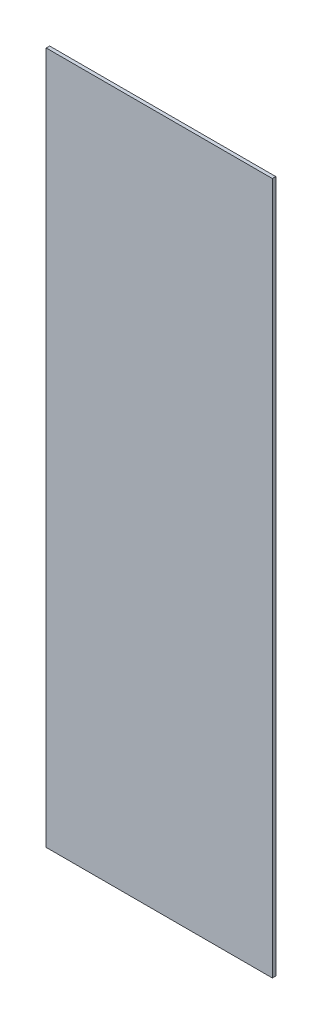
ISO-10303-21;
HEADER;
FILE_DESCRIPTION(('STEP AP214'),'2;1');
FILE_NAME('part.step','',(''),(''),'','','');
FILE_SCHEMA(('AUTOMOTIVE_DESIGN { 1 0 10303 214 1 1 1 1 }'));
ENDSEC;
DATA;
#1=APPLICATION_CONTEXT('core data for automotive mechanical design processes');
#2=APPLICATION_PROTOCOL_DEFINITION('international standard','automotive_design',2000,#1);
#3=PRODUCT_CONTEXT('',#1,'mechanical');
#4=PRODUCT('Part','Part','',(#3));
#5=PRODUCT_RELATED_PRODUCT_CATEGORY('part','',(#4));
#6=PRODUCT_DEFINITION_FORMATION('','',#4);
#7=PRODUCT_DEFINITION_CONTEXT('part definition',#1,'design');
#8=PRODUCT_DEFINITION('design','',#6,#7);
#9=PRODUCT_DEFINITION_SHAPE('','',#8);
#10=(LENGTH_UNIT() NAMED_UNIT(*) SI_UNIT(.MILLI.,.METRE.));
#11=(NAMED_UNIT(*) PLANE_ANGLE_UNIT() SI_UNIT($,.RADIAN.));
#12=(NAMED_UNIT(*) SI_UNIT($,.STERADIAN.) SOLID_ANGLE_UNIT());
#13=UNCERTAINTY_MEASURE_WITH_UNIT(LENGTH_MEASURE(1.E-05),#10,'distance_accuracy_value','');
#14=(GEOMETRIC_REPRESENTATION_CONTEXT(3) GLOBAL_UNCERTAINTY_ASSIGNED_CONTEXT((#13)) GLOBAL_UNIT_ASSIGNED_CONTEXT((#10,
#11,#12)) REPRESENTATION_CONTEXT('',''));
#15=CARTESIAN_POINT('',(0.,0.,0.));
#16=DIRECTION('',(0.,0.,1.));
#17=DIRECTION('',(1.,0.,0.));
#18=AXIS2_PLACEMENT_3D('',#15,#16,#17);
#19=CARTESIAN_POINT('',(-311.909422308907,134.759450171821,5.));
#20=DIRECTION('',(1.,0.,0.));
#21=DIRECTION('',(0.,1.,0.));
#22=AXIS2_PLACEMENT_3D('',#19,#20,#21);
#23=PLANE('',#22);
#24=DIRECTION('',(0.,-1.,0.));
#25=VECTOR('',#24,1.);
#26=CARTESIAN_POINT('',(-311.909422308907,134.759450171821,0.));
#27=LINE('',#26,#25);
#28=CARTESIAN_POINT('',(-311.909422308907,134.759450171821,0.));
#29=VERTEX_POINT('',#28);
#30=CARTESIAN_POINT('',(-311.909422308907,-875.740549828179,0.));
#31=VERTEX_POINT('',#30);
#32=EDGE_CURVE('E107',#29,#31,#27,.T.);
#33=ORIENTED_EDGE('',*,*,#32,.T.);
#34=DIRECTION('',(0.,0.,-1.));
#35=VECTOR('',#34,1.);
#36=CARTESIAN_POINT('',(-311.909422308907,-875.740549828179,5.));
#37=LINE('',#36,#35);
#38=CARTESIAN_POINT('',(-311.909422308907,-875.740549828179,5.));
#39=VERTEX_POINT('',#38);
#40=EDGE_CURVE('E11',#39,#31,#37,.T.);
#41=ORIENTED_EDGE('',*,*,#40,.F.);
#42=DIRECTION('',(0.,-1.,0.));
#43=VECTOR('',#42,1.);
#44=CARTESIAN_POINT('',(-311.909422308907,134.759450171821,5.));
#45=LINE('',#44,#43);
#46=CARTESIAN_POINT('',(-311.909422308907,134.759450171821,5.));
#47=VERTEX_POINT('',#46);
#48=EDGE_CURVE('E91',#47,#39,#45,.T.);
#49=ORIENTED_EDGE('',*,*,#48,.F.);
#50=DIRECTION('',(0.,0.,-1.));
#51=VECTOR('',#50,1.);
#52=CARTESIAN_POINT('',(-311.909422308907,134.759450171821,5.));
#53=LINE('',#52,#51);
#54=EDGE_CURVE('E103',#47,#29,#53,.T.);
#55=ORIENTED_EDGE('',*,*,#54,.T.);
#56=EDGE_LOOP('',(#33,#41,#49,#55));
#57=FACE_BOUND('',#56,.T.);
#58=ADVANCED_FACE('F39',(#57),#23,.F.);
#59=CARTESIAN_POINT('',(-311.909422308907,-875.740549828179,5.));
#60=DIRECTION('',(0.,1.,0.));
#61=DIRECTION('',(0.,0.,1.));
#62=AXIS2_PLACEMENT_3D('',#59,#60,#61);
#63=PLANE('',#62);
#64=DIRECTION('',(1.,0.,0.));
#65=VECTOR('',#64,1.);
#66=CARTESIAN_POINT('',(-311.909422308907,-875.740549828179,0.));
#67=LINE('',#66,#65);
#68=CARTESIAN_POINT('',(18.0905776910933,-875.740549828179,0.));
#69=VERTEX_POINT('',#68);
#70=EDGE_CURVE('E96',#31,#69,#67,.T.);
#71=ORIENTED_EDGE('',*,*,#70,.T.);
#72=DIRECTION('',(0.,0.,-1.));
#73=VECTOR('',#72,1.);
#74=CARTESIAN_POINT('',(18.0905776910933,-875.740549828179,5.));
#75=LINE('',#74,#73);
#76=CARTESIAN_POINT('',(18.0905776910933,-875.740549828179,5.));
#77=VERTEX_POINT('',#76);
#78=EDGE_CURVE('E48',#77,#69,#75,.T.);
#79=ORIENTED_EDGE('',*,*,#78,.F.);
#80=DIRECTION('',(1.,0.,0.));
#81=VECTOR('',#80,1.);
#82=CARTESIAN_POINT('',(-311.909422308907,-875.740549828179,5.));
#83=LINE('',#82,#81);
#84=EDGE_CURVE('E86',#39,#77,#83,.T.);
#85=ORIENTED_EDGE('',*,*,#84,.F.);
#86=ORIENTED_EDGE('',*,*,#40,.T.);
#87=EDGE_LOOP('',(#71,#79,#85,#86));
#88=FACE_BOUND('',#87,.T.);
#89=ADVANCED_FACE('F95',(#88),#63,.F.);
#90=CARTESIAN_POINT('',(18.0905776910932,134.759450171821,5.));
#91=DIRECTION('',(-1.,0.,0.));
#92=DIRECTION('',(0.,-1.,0.));
#93=AXIS2_PLACEMENT_3D('',#90,#91,#92);
#94=PLANE('',#93);
#95=DIRECTION('',(0.,1.,0.));
#96=VECTOR('',#95,1.);
#97=CARTESIAN_POINT('',(18.0905776910932,134.759450171821,0.));
#98=LINE('',#97,#96);
#99=CARTESIAN_POINT('',(18.0905776910932,134.759450171821,0.));
#100=VERTEX_POINT('',#99);
#101=EDGE_CURVE('E73',#69,#100,#98,.T.);
#102=ORIENTED_EDGE('',*,*,#101,.T.);
#103=DIRECTION('',(0.,0.,-1.));
#104=VECTOR('',#103,1.);
#105=CARTESIAN_POINT('',(18.0905776910932,134.759450171821,5.));
#106=LINE('',#105,#104);
#107=CARTESIAN_POINT('',(18.0905776910932,134.759450171821,5.));
#108=VERTEX_POINT('',#107);
#109=EDGE_CURVE('E98',#108,#100,#106,.T.);
#110=ORIENTED_EDGE('',*,*,#109,.F.);
#111=DIRECTION('',(0.,1.,0.));
#112=VECTOR('',#111,1.);
#113=CARTESIAN_POINT('',(18.0905776910932,134.759450171821,5.));
#114=LINE('',#113,#112);
#115=EDGE_CURVE('E89',#77,#108,#114,.T.);
#116=ORIENTED_EDGE('',*,*,#115,.F.);
#117=ORIENTED_EDGE('',*,*,#78,.T.);
#118=EDGE_LOOP('',(#102,#110,#116,#117));
#119=FACE_BOUND('',#118,.T.);
#120=ADVANCED_FACE('F99',(#119),#94,.F.);
#121=CARTESIAN_POINT('',(-311.909422308907,134.759450171821,5.));
#122=DIRECTION('',(0.,-1.,0.));
#123=DIRECTION('',(0.,0.,-1.));
#124=AXIS2_PLACEMENT_3D('',#121,#122,#123);
#125=PLANE('',#124);
#126=DIRECTION('',(-1.,0.,0.));
#127=VECTOR('',#126,1.);
#128=CARTESIAN_POINT('',(-311.909422308907,134.759450171821,0.));
#129=LINE('',#128,#127);
#130=EDGE_CURVE('E79',#100,#29,#129,.T.);
#131=ORIENTED_EDGE('',*,*,#130,.T.);
#132=ORIENTED_EDGE('',*,*,#54,.F.);
#133=DIRECTION('',(-1.,0.,0.));
#134=VECTOR('',#133,1.);
#135=CARTESIAN_POINT('',(-311.909422308907,134.759450171821,5.));
#136=LINE('',#135,#134);
#137=EDGE_CURVE('E56',#108,#47,#136,.T.);
#138=ORIENTED_EDGE('',*,*,#137,.F.);
#139=ORIENTED_EDGE('',*,*,#109,.T.);
#140=EDGE_LOOP('',(#131,#132,#138,#139));
#141=FACE_BOUND('',#140,.T.);
#142=ADVANCED_FACE('F120',(#141),#125,.F.);
#143=CARTESIAN_POINT('',(0.,0.,5.));
#144=DIRECTION('',(0.,0.,1.));
#145=DIRECTION('',(1.,0.,0.));
#146=AXIS2_PLACEMENT_3D('',#143,#144,#145);
#147=PLANE('',#146);
#148=ORIENTED_EDGE('',*,*,#48,.T.);
#149=ORIENTED_EDGE('',*,*,#84,.T.);
#150=ORIENTED_EDGE('',*,*,#115,.T.);
#151=ORIENTED_EDGE('',*,*,#137,.T.);
#152=EDGE_LOOP('',(#148,#149,#150,#151));
#153=FACE_BOUND('',#152,.T.);
#154=ADVANCED_FACE('F87',(#153),#147,.T.);
#155=CARTESIAN_POINT('',(0.,0.,0.));
#156=DIRECTION('',(0.,0.,1.));
#157=DIRECTION('',(1.,0.,0.));
#158=AXIS2_PLACEMENT_3D('',#155,#156,#157);
#159=PLANE('',#158);
#160=ORIENTED_EDGE('',*,*,#32,.F.);
#161=ORIENTED_EDGE('',*,*,#130,.F.);
#162=ORIENTED_EDGE('',*,*,#101,.F.);
#163=ORIENTED_EDGE('',*,*,#70,.F.);
#164=EDGE_LOOP('',(#160,#161,#162,#163));
#165=FACE_BOUND('',#164,.T.);
#166=ADVANCED_FACE('F123',(#165),#159,.F.);
#167=CLOSED_SHELL('',(#58,#89,#120,#142,#154,#166));
#168=MANIFOLD_SOLID_BREP('B2',#167);
#169=ADVANCED_BREP_SHAPE_REPRESENTATION('',(#18,#168),#14);
#170=SHAPE_DEFINITION_REPRESENTATION(#9,#169);
ENDSEC;
END-ISO-10303-21;
